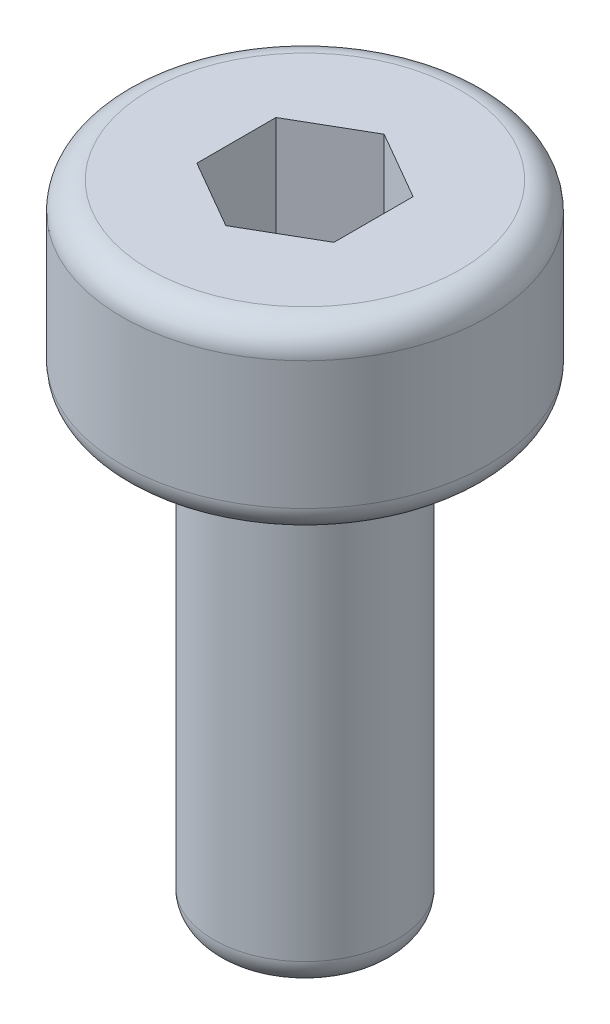
ISO-10303-21;
HEADER;
FILE_DESCRIPTION(('STEP AP214'),'2;1');
FILE_NAME('part.step','',(''),(''),'','','');
FILE_SCHEMA(('AUTOMOTIVE_DESIGN { 1 0 10303 214 1 1 1 1 }'));
ENDSEC;
DATA;
#1=APPLICATION_CONTEXT('core data for automotive mechanical design processes');
#2=APPLICATION_PROTOCOL_DEFINITION('international standard','automotive_design',2000,#1);
#3=PRODUCT_CONTEXT('',#1,'mechanical');
#4=PRODUCT('Part','Part','',(#3));
#5=PRODUCT_RELATED_PRODUCT_CATEGORY('part','',(#4));
#6=PRODUCT_DEFINITION_FORMATION('','',#4);
#7=PRODUCT_DEFINITION_CONTEXT('part definition',#1,'design');
#8=PRODUCT_DEFINITION('design','',#6,#7);
#9=PRODUCT_DEFINITION_SHAPE('','',#8);
#10=(LENGTH_UNIT() NAMED_UNIT(*) SI_UNIT(.MILLI.,.METRE.));
#11=(NAMED_UNIT(*) PLANE_ANGLE_UNIT() SI_UNIT($,.RADIAN.));
#12=(NAMED_UNIT(*) SI_UNIT($,.STERADIAN.) SOLID_ANGLE_UNIT());
#13=UNCERTAINTY_MEASURE_WITH_UNIT(LENGTH_MEASURE(1.E-05),#10,'distance_accuracy_value','');
#14=(GEOMETRIC_REPRESENTATION_CONTEXT(3) GLOBAL_UNCERTAINTY_ASSIGNED_CONTEXT((#13)) GLOBAL_UNIT_ASSIGNED_CONTEXT((#10,
#11,#12)) REPRESENTATION_CONTEXT('',''));
#15=CARTESIAN_POINT('',(0.,0.,0.));
#16=DIRECTION('',(0.,0.,1.));
#17=DIRECTION('',(1.,0.,0.));
#18=AXIS2_PLACEMENT_3D('',#15,#16,#17);
#19=CARTESIAN_POINT('',(0.,0.,0.));
#20=DIRECTION('',(0.,-1.,0.));
#21=DIRECTION('',(1.,0.,0.));
#22=AXIS2_PLACEMENT_3D('',#19,#20,#21);
#23=CYLINDRICAL_SURFACE('',#22,2.);
#24=CARTESIAN_POINT('',(0.,-0.3,0.));
#25=DIRECTION('',(0.,1.,0.));
#26=DIRECTION('',(-1.,0.,0.));
#27=AXIS2_PLACEMENT_3D('',#24,#25,#26);
#28=CIRCLE('',#27,2.);
#29=CARTESIAN_POINT('',(-2.,-0.3,0.));
#30=VERTEX_POINT('',#29);
#31=EDGE_CURVE('E162',#30,#30,#28,.F.);
#32=ORIENTED_EDGE('',*,*,#31,.T.);
#33=EDGE_LOOP('',(#32));
#34=FACE_BOUND('',#33,.T.);
#35=CARTESIAN_POINT('',(0.,-1.7,0.));
#36=DIRECTION('',(0.,-1.,0.));
#37=DIRECTION('',(1.,0.,0.));
#38=AXIS2_PLACEMENT_3D('',#35,#36,#37);
#39=CIRCLE('',#38,2.);
#40=CARTESIAN_POINT('',(2.,-1.7,0.));
#41=VERTEX_POINT('',#40);
#42=EDGE_CURVE('E159',#41,#41,#39,.F.);
#43=ORIENTED_EDGE('',*,*,#42,.T.);
#44=EDGE_LOOP('',(#43));
#45=FACE_BOUND('',#44,.T.);
#46=ADVANCED_FACE('F43',(#34,#45),#23,.T.);
#47=CARTESIAN_POINT('',(2.,0.,0.));
#48=DIRECTION('',(0.,1.,0.));
#49=DIRECTION('',(-1.,0.,0.));
#50=AXIS2_PLACEMENT_3D('',#47,#48,#49);
#51=PLANE('',#50);
#52=CARTESIAN_POINT('',(0.,0.,0.));
#53=DIRECTION('',(0.,1.,0.));
#54=DIRECTION('',(-1.,0.,0.));
#55=AXIS2_PLACEMENT_3D('',#52,#53,#54);
#56=CIRCLE('',#55,1.7);
#57=CARTESIAN_POINT('',(-1.7,0.,0.));
#58=VERTEX_POINT('',#57);
#59=EDGE_CURVE('E51',#58,#58,#56,.T.);
#60=ORIENTED_EDGE('',*,*,#59,.T.);
#61=EDGE_LOOP('',(#60));
#62=FACE_BOUND('',#61,.T.);
#63=DIRECTION('',(-0.866025403784438,0.,-0.5));
#64=VECTOR('',#63,1.);
#65=CARTESIAN_POINT('',(0.75,0.,-0.433012701892219));
#66=LINE('',#65,#64);
#67=CARTESIAN_POINT('',(0.75,0.,-0.433012701892219));
#68=VERTEX_POINT('',#67);
#69=CARTESIAN_POINT('',(0.,0.,-0.866025403784439));
#70=VERTEX_POINT('',#69);
#71=EDGE_CURVE('E58',#68,#70,#66,.T.);
#72=ORIENTED_EDGE('',*,*,#71,.F.);
#73=DIRECTION('',(0.,0.,-1.));
#74=VECTOR('',#73,1.);
#75=CARTESIAN_POINT('',(0.75,0.,0.433012701892219));
#76=LINE('',#75,#74);
#77=CARTESIAN_POINT('',(0.75,0.,0.433012701892219));
#78=VERTEX_POINT('',#77);
#79=EDGE_CURVE('E141',#78,#68,#76,.T.);
#80=ORIENTED_EDGE('',*,*,#79,.F.);
#81=DIRECTION('',(0.866025403784439,0.,-0.5));
#82=VECTOR('',#81,1.);
#83=CARTESIAN_POINT('',(0.,0.,0.866025403784439));
#84=LINE('',#83,#82);
#85=CARTESIAN_POINT('',(0.,0.,0.866025403784439));
#86=VERTEX_POINT('',#85);
#87=EDGE_CURVE('E139',#86,#78,#84,.T.);
#88=ORIENTED_EDGE('',*,*,#87,.F.);
#89=DIRECTION('',(0.866025403784439,0.,0.5));
#90=VECTOR('',#89,1.);
#91=CARTESIAN_POINT('',(-0.75,0.,0.43301270189222));
#92=LINE('',#91,#90);
#93=CARTESIAN_POINT('',(-0.75,0.,0.43301270189222));
#94=VERTEX_POINT('',#93);
#95=EDGE_CURVE('E106',#94,#86,#92,.T.);
#96=ORIENTED_EDGE('',*,*,#95,.F.);
#97=DIRECTION('',(0.,0.,1.));
#98=VECTOR('',#97,1.);
#99=CARTESIAN_POINT('',(-0.75,0.,-0.433012701892219));
#100=LINE('',#99,#98);
#101=CARTESIAN_POINT('',(-0.75,0.,-0.433012701892219));
#102=VERTEX_POINT('',#101);
#103=EDGE_CURVE('E135',#102,#94,#100,.T.);
#104=ORIENTED_EDGE('',*,*,#103,.F.);
#105=DIRECTION('',(-0.866025403784438,0.,0.5));
#106=VECTOR('',#105,1.);
#107=CARTESIAN_POINT('',(0.,0.,-0.866025403784439));
#108=LINE('',#107,#106);
#109=EDGE_CURVE('E132',#70,#102,#108,.T.);
#110=ORIENTED_EDGE('',*,*,#109,.F.);
#111=EDGE_LOOP('',(#72,#80,#88,#96,#104,#110));
#112=FACE_BOUND('',#111,.T.);
#113=ADVANCED_FACE('F167',(#62,#112),#51,.T.);
#114=CARTESIAN_POINT('',(0.,-2.,0.));
#115=DIRECTION('',(0.,-1.,0.));
#116=DIRECTION('',(1.,0.,0.));
#117=AXIS2_PLACEMENT_3D('',#114,#115,#116);
#118=PLANE('',#117);
#119=CARTESIAN_POINT('',(0.,-2.,0.));
#120=DIRECTION('',(0.,-1.,0.));
#121=DIRECTION('',(1.,0.,0.));
#122=AXIS2_PLACEMENT_3D('',#119,#120,#121);
#123=CIRCLE('',#122,1.7);
#124=CARTESIAN_POINT('',(1.7,-2.,0.));
#125=VERTEX_POINT('',#124);
#126=EDGE_CURVE('E11',#125,#125,#123,.T.);
#127=ORIENTED_EDGE('',*,*,#126,.T.);
#128=EDGE_LOOP('',(#127));
#129=FACE_BOUND('',#128,.T.);
#130=CARTESIAN_POINT('',(0.,-2.,0.));
#131=DIRECTION('',(0.,-1.,0.));
#132=DIRECTION('',(0.,0.,-1.));
#133=AXIS2_PLACEMENT_3D('',#130,#131,#132);
#134=CIRCLE('',#133,1.);
#135=CARTESIAN_POINT('',(0.,-2.,-1.));
#136=VERTEX_POINT('',#135);
#137=EDGE_CURVE('E145',#136,#136,#134,.T.);
#138=ORIENTED_EDGE('',*,*,#137,.F.);
#139=EDGE_LOOP('',(#138));
#140=FACE_BOUND('',#139,.T.);
#141=ADVANCED_FACE('F185',(#129,#140),#118,.T.);
#142=CARTESIAN_POINT('',(0.,-7.,0.));
#143=DIRECTION('',(0.,1.,0.));
#144=DIRECTION('',(0.,0.,1.));
#145=AXIS2_PLACEMENT_3D('',#142,#143,#144);
#146=CYLINDRICAL_SURFACE('',#145,1.);
#147=CARTESIAN_POINT('',(0.,-6.7,0.));
#148=DIRECTION('',(0.,-1.,0.));
#149=DIRECTION('',(0.,0.,-1.));
#150=AXIS2_PLACEMENT_3D('',#147,#148,#149);
#151=CIRCLE('',#150,1.);
#152=CARTESIAN_POINT('',(0.,-6.7,-1.));
#153=VERTEX_POINT('',#152);
#154=EDGE_CURVE('E156',#153,#153,#151,.F.);
#155=ORIENTED_EDGE('',*,*,#154,.T.);
#156=EDGE_LOOP('',(#155));
#157=FACE_BOUND('',#156,.T.);
#158=ORIENTED_EDGE('',*,*,#137,.T.);
#159=EDGE_LOOP('',(#158));
#160=FACE_BOUND('',#159,.T.);
#161=ADVANCED_FACE('F188',(#157,#160),#146,.T.);
#162=CARTESIAN_POINT('',(0.,-7.,0.));
#163=DIRECTION('',(0.,-1.,0.));
#164=DIRECTION('',(0.,0.,-1.));
#165=AXIS2_PLACEMENT_3D('',#162,#163,#164);
#166=PLANE('',#165);
#167=CARTESIAN_POINT('',(0.,-7.,0.));
#168=DIRECTION('',(0.,-1.,0.));
#169=DIRECTION('',(0.,0.,-1.));
#170=AXIS2_PLACEMENT_3D('',#167,#168,#169);
#171=CIRCLE('',#170,0.7);
#172=CARTESIAN_POINT('',(0.,-7.,-0.7));
#173=VERTEX_POINT('',#172);
#174=EDGE_CURVE('E153',#173,#173,#171,.T.);
#175=ORIENTED_EDGE('',*,*,#174,.T.);
#176=EDGE_LOOP('',(#175));
#177=FACE_BOUND('',#176,.T.);
#178=ADVANCED_FACE('F193',(#177),#166,.T.);
#179=CARTESIAN_POINT('',(0.75,-1.5,-0.433012701892219));
#180=DIRECTION('',(0.5,0.,-0.866025403784439));
#181=DIRECTION('',(-0.866025403784439,0.,-0.5));
#182=AXIS2_PLACEMENT_3D('',#179,#180,#181);
#183=PLANE('',#182);
#184=ORIENTED_EDGE('',*,*,#71,.T.);
#185=DIRECTION('',(0.,1.,0.));
#186=VECTOR('',#185,1.);
#187=CARTESIAN_POINT('',(0.,-1.5,-0.866025403784439));
#188=LINE('',#187,#186);
#189=CARTESIAN_POINT('',(0.,-1.5,-0.866025403784439));
#190=VERTEX_POINT('',#189);
#191=EDGE_CURVE('E88',#190,#70,#188,.T.);
#192=ORIENTED_EDGE('',*,*,#191,.F.);
#193=DIRECTION('',(-0.866025403784438,0.,-0.5));
#194=VECTOR('',#193,1.);
#195=CARTESIAN_POINT('',(0.75,-1.5,-0.433012701892219));
#196=LINE('',#195,#194);
#197=CARTESIAN_POINT('',(0.75,-1.5,-0.433012701892219));
#198=VERTEX_POINT('',#197);
#199=EDGE_CURVE('E143',#198,#190,#196,.T.);
#200=ORIENTED_EDGE('',*,*,#199,.F.);
#201=DIRECTION('',(0.,1.,0.));
#202=VECTOR('',#201,1.);
#203=CARTESIAN_POINT('',(0.75,-1.5,-0.433012701892219));
#204=LINE('',#203,#202);
#205=EDGE_CURVE('E66',#198,#68,#204,.T.);
#206=ORIENTED_EDGE('',*,*,#205,.T.);
#207=EDGE_LOOP('',(#184,#192,#200,#206));
#208=FACE_BOUND('',#207,.T.);
#209=ADVANCED_FACE('F199',(#208),#183,.F.);
#210=CARTESIAN_POINT('',(0.75,-1.5,0.433012701892219));
#211=DIRECTION('',(1.,0.,0.));
#212=DIRECTION('',(0.,0.,-1.));
#213=AXIS2_PLACEMENT_3D('',#210,#211,#212);
#214=PLANE('',#213);
#215=ORIENTED_EDGE('',*,*,#79,.T.);
#216=ORIENTED_EDGE('',*,*,#205,.F.);
#217=DIRECTION('',(0.,0.,-1.));
#218=VECTOR('',#217,1.);
#219=CARTESIAN_POINT('',(0.75,-1.5,0.433012701892219));
#220=LINE('',#219,#218);
#221=CARTESIAN_POINT('',(0.75,-1.5,0.433012701892219));
#222=VERTEX_POINT('',#221);
#223=EDGE_CURVE('E118',#222,#198,#220,.T.);
#224=ORIENTED_EDGE('',*,*,#223,.F.);
#225=DIRECTION('',(0.,1.,0.));
#226=VECTOR('',#225,1.);
#227=CARTESIAN_POINT('',(0.75,-1.5,0.433012701892219));
#228=LINE('',#227,#226);
#229=EDGE_CURVE('E110',#222,#78,#228,.T.);
#230=ORIENTED_EDGE('',*,*,#229,.T.);
#231=EDGE_LOOP('',(#215,#216,#224,#230));
#232=FACE_BOUND('',#231,.T.);
#233=ADVANCED_FACE('F223',(#232),#214,.F.);
#234=CARTESIAN_POINT('',(0.,-1.5,0.866025403784439));
#235=DIRECTION('',(0.5,0.,0.866025403784439));
#236=DIRECTION('',(0.866025403784439,0.,-0.5));
#237=AXIS2_PLACEMENT_3D('',#234,#235,#236);
#238=PLANE('',#237);
#239=ORIENTED_EDGE('',*,*,#87,.T.);
#240=ORIENTED_EDGE('',*,*,#229,.F.);
#241=DIRECTION('',(0.866025403784439,0.,-0.5));
#242=VECTOR('',#241,1.);
#243=CARTESIAN_POINT('',(0.,-1.5,0.866025403784439));
#244=LINE('',#243,#242);
#245=CARTESIAN_POINT('',(0.,-1.5,0.866025403784439));
#246=VERTEX_POINT('',#245);
#247=EDGE_CURVE('E114',#246,#222,#244,.T.);
#248=ORIENTED_EDGE('',*,*,#247,.F.);
#249=DIRECTION('',(0.,1.,0.));
#250=VECTOR('',#249,1.);
#251=CARTESIAN_POINT('',(0.,-1.5,0.866025403784439));
#252=LINE('',#251,#250);
#253=EDGE_CURVE('E99',#246,#86,#252,.T.);
#254=ORIENTED_EDGE('',*,*,#253,.T.);
#255=EDGE_LOOP('',(#239,#240,#248,#254));
#256=FACE_BOUND('',#255,.T.);
#257=ADVANCED_FACE('F115',(#256),#238,.F.);
#258=CARTESIAN_POINT('',(-0.75,-1.5,0.43301270189222));
#259=DIRECTION('',(-0.5,0.,0.866025403784439));
#260=DIRECTION('',(0.866025403784439,0.,0.5));
#261=AXIS2_PLACEMENT_3D('',#258,#259,#260);
#262=PLANE('',#261);
#263=ORIENTED_EDGE('',*,*,#95,.T.);
#264=ORIENTED_EDGE('',*,*,#253,.F.);
#265=DIRECTION('',(0.866025403784439,0.,0.5));
#266=VECTOR('',#265,1.);
#267=CARTESIAN_POINT('',(-0.75,-1.5,0.43301270189222));
#268=LINE('',#267,#266);
#269=CARTESIAN_POINT('',(-0.75,-1.5,0.43301270189222));
#270=VERTEX_POINT('',#269);
#271=EDGE_CURVE('E103',#270,#246,#268,.T.);
#272=ORIENTED_EDGE('',*,*,#271,.F.);
#273=DIRECTION('',(0.,1.,0.));
#274=VECTOR('',#273,1.);
#275=CARTESIAN_POINT('',(-0.75,-1.5,0.43301270189222));
#276=LINE('',#275,#274);
#277=EDGE_CURVE('E111',#270,#94,#276,.T.);
#278=ORIENTED_EDGE('',*,*,#277,.T.);
#279=EDGE_LOOP('',(#263,#264,#272,#278));
#280=FACE_BOUND('',#279,.T.);
#281=ADVANCED_FACE('F101',(#280),#262,.F.);
#282=CARTESIAN_POINT('',(-0.75,-1.5,-0.433012701892219));
#283=DIRECTION('',(-1.,0.,0.));
#284=DIRECTION('',(0.,0.,1.));
#285=AXIS2_PLACEMENT_3D('',#282,#283,#284);
#286=PLANE('',#285);
#287=ORIENTED_EDGE('',*,*,#103,.T.);
#288=ORIENTED_EDGE('',*,*,#277,.F.);
#289=DIRECTION('',(0.,0.,1.));
#290=VECTOR('',#289,1.);
#291=CARTESIAN_POINT('',(-0.75,-1.5,-0.433012701892219));
#292=LINE('',#291,#290);
#293=CARTESIAN_POINT('',(-0.75,-1.5,-0.433012701892219));
#294=VERTEX_POINT('',#293);
#295=EDGE_CURVE('E124',#294,#270,#292,.T.);
#296=ORIENTED_EDGE('',*,*,#295,.F.);
#297=DIRECTION('',(0.,1.,0.));
#298=VECTOR('',#297,1.);
#299=CARTESIAN_POINT('',(-0.75,-1.5,-0.433012701892219));
#300=LINE('',#299,#298);
#301=EDGE_CURVE('E148',#294,#102,#300,.T.);
#302=ORIENTED_EDGE('',*,*,#301,.T.);
#303=EDGE_LOOP('',(#287,#288,#296,#302));
#304=FACE_BOUND('',#303,.T.);
#305=ADVANCED_FACE('F219',(#304),#286,.F.);
#306=CARTESIAN_POINT('',(0.,-1.5,-0.866025403784439));
#307=DIRECTION('',(-0.5,0.,-0.866025403784438));
#308=DIRECTION('',(-0.866025403784438,0.,0.5));
#309=AXIS2_PLACEMENT_3D('',#306,#307,#308);
#310=PLANE('',#309);
#311=ORIENTED_EDGE('',*,*,#109,.T.);
#312=ORIENTED_EDGE('',*,*,#301,.F.);
#313=DIRECTION('',(-0.866025403784438,0.,0.5));
#314=VECTOR('',#313,1.);
#315=CARTESIAN_POINT('',(0.,-1.5,-0.866025403784439));
#316=LINE('',#315,#314);
#317=EDGE_CURVE('E126',#190,#294,#316,.T.);
#318=ORIENTED_EDGE('',*,*,#317,.F.);
#319=ORIENTED_EDGE('',*,*,#191,.T.);
#320=EDGE_LOOP('',(#311,#312,#318,#319));
#321=FACE_BOUND('',#320,.T.);
#322=ADVANCED_FACE('F211',(#321),#310,.F.);
#323=CARTESIAN_POINT('',(0.,-1.5,0.));
#324=DIRECTION('',(0.,1.,0.));
#325=DIRECTION('',(0.,0.,1.));
#326=AXIS2_PLACEMENT_3D('',#323,#324,#325);
#327=PLANE('',#326);
#328=ORIENTED_EDGE('',*,*,#199,.T.);
#329=ORIENTED_EDGE('',*,*,#317,.T.);
#330=ORIENTED_EDGE('',*,*,#295,.T.);
#331=ORIENTED_EDGE('',*,*,#271,.T.);
#332=ORIENTED_EDGE('',*,*,#247,.T.);
#333=ORIENTED_EDGE('',*,*,#223,.T.);
#334=EDGE_LOOP('',(#328,#329,#330,#331,#332,#333));
#335=FACE_BOUND('',#334,.T.);
#336=ADVANCED_FACE('F121',(#335),#327,.T.);
#337=CARTESIAN_POINT('',(0.,-6.7,0.));
#338=DIRECTION('',(0.,-1.,0.));
#339=DIRECTION('',(0.,0.,-1.));
#340=AXIS2_PLACEMENT_3D('',#337,#338,#339);
#341=TOROIDAL_SURFACE('',#340,0.7,0.3);
#342=ORIENTED_EDGE('',*,*,#154,.F.);
#343=EDGE_LOOP('',(#342));
#344=FACE_BOUND('',#343,.T.);
#345=ORIENTED_EDGE('',*,*,#174,.F.);
#346=EDGE_LOOP('',(#345));
#347=FACE_BOUND('',#346,.T.);
#348=ADVANCED_FACE('F173',(#344,#347),#341,.T.);
#349=CARTESIAN_POINT('',(0.,-0.3,0.));
#350=DIRECTION('',(0.,1.,0.));
#351=DIRECTION('',(-1.,0.,0.));
#352=AXIS2_PLACEMENT_3D('',#349,#350,#351);
#353=TOROIDAL_SURFACE('',#352,1.7,0.3);
#354=ORIENTED_EDGE('',*,*,#59,.F.);
#355=EDGE_LOOP('',(#354));
#356=FACE_BOUND('',#355,.T.);
#357=ORIENTED_EDGE('',*,*,#31,.F.);
#358=EDGE_LOOP('',(#357));
#359=FACE_BOUND('',#358,.T.);
#360=ADVANCED_FACE('F170',(#356,#359),#353,.T.);
#361=CARTESIAN_POINT('',(0.,-1.7,0.));
#362=DIRECTION('',(0.,-1.,0.));
#363=DIRECTION('',(1.,0.,0.));
#364=AXIS2_PLACEMENT_3D('',#361,#362,#363);
#365=TOROIDAL_SURFACE('',#364,1.7,0.3);
#366=ORIENTED_EDGE('',*,*,#42,.F.);
#367=EDGE_LOOP('',(#366));
#368=FACE_BOUND('',#367,.T.);
#369=ORIENTED_EDGE('',*,*,#126,.F.);
#370=EDGE_LOOP('',(#369));
#371=FACE_BOUND('',#370,.T.);
#372=ADVANCED_FACE('F45',(#368,#371),#365,.T.);
#373=CLOSED_SHELL('',(#46,#113,#141,#161,#178,#209,#233,#257,#281,#305,#322,#336,#348,#360,#372));
#374=MANIFOLD_SOLID_BREP('B2',#373);
#375=ADVANCED_BREP_SHAPE_REPRESENTATION('',(#18,#374),#14);
#376=SHAPE_DEFINITION_REPRESENTATION(#9,#375);
ENDSEC;
END-ISO-10303-21;
